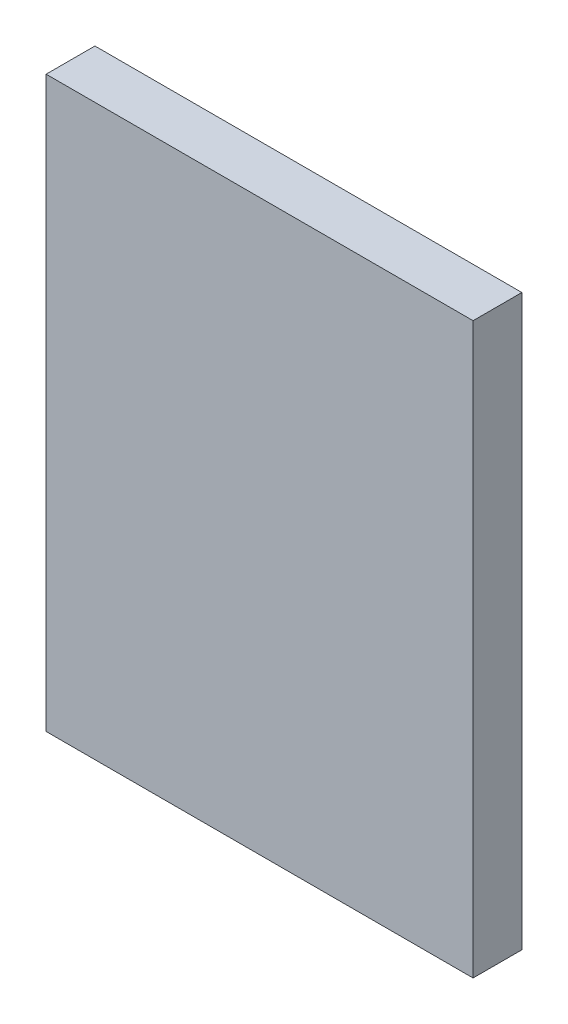
ISO-10303-21;
HEADER;
FILE_DESCRIPTION(('STEP AP214'),'2;1');
FILE_NAME('part.step','',(''),(''),'','','');
FILE_SCHEMA(('AUTOMOTIVE_DESIGN { 1 0 10303 214 1 1 1 1 }'));
ENDSEC;
DATA;
#1=APPLICATION_CONTEXT('core data for automotive mechanical design processes');
#2=APPLICATION_PROTOCOL_DEFINITION('international standard','automotive_design',2000,#1);
#3=PRODUCT_CONTEXT('',#1,'mechanical');
#4=PRODUCT('Part','Part','',(#3));
#5=PRODUCT_RELATED_PRODUCT_CATEGORY('part','',(#4));
#6=PRODUCT_DEFINITION_FORMATION('','',#4);
#7=PRODUCT_DEFINITION_CONTEXT('part definition',#1,'design');
#8=PRODUCT_DEFINITION('design','',#6,#7);
#9=PRODUCT_DEFINITION_SHAPE('','',#8);
#10=(LENGTH_UNIT() NAMED_UNIT(*) SI_UNIT(.MILLI.,.METRE.));
#11=(NAMED_UNIT(*) PLANE_ANGLE_UNIT() SI_UNIT($,.RADIAN.));
#12=(NAMED_UNIT(*) SI_UNIT($,.STERADIAN.) SOLID_ANGLE_UNIT());
#13=UNCERTAINTY_MEASURE_WITH_UNIT(LENGTH_MEASURE(1.E-05),#10,'distance_accuracy_value','');
#14=(GEOMETRIC_REPRESENTATION_CONTEXT(3) GLOBAL_UNCERTAINTY_ASSIGNED_CONTEXT((#13)) GLOBAL_UNIT_ASSIGNED_CONTEXT((#10,
#11,#12)) REPRESENTATION_CONTEXT('',''));
#15=CARTESIAN_POINT('',(0.,0.,0.));
#16=DIRECTION('',(0.,0.,1.));
#17=DIRECTION('',(1.,0.,0.));
#18=AXIS2_PLACEMENT_3D('',#15,#16,#17);
#19=CARTESIAN_POINT('',(7.6283,2.2606,0.76487));
#20=DIRECTION('',(0.,0.,-1.));
#21=DIRECTION('',(-1.,0.,0.));
#22=AXIS2_PLACEMENT_3D('',#19,#20,#21);
#23=PLANE('',#22);
#24=DIRECTION('',(1.,0.,0.));
#25=VECTOR('',#24,1.);
#26=CARTESIAN_POINT('',(7.4783,2.4606,0.76487));
#27=LINE('',#26,#25);
#28=CARTESIAN_POINT('',(7.4783,2.4606,0.76487));
#29=VERTEX_POINT('',#28);
#30=CARTESIAN_POINT('',(7.7783,2.4606,0.76487));
#31=VERTEX_POINT('',#30);
#32=EDGE_CURVE('E55',#29,#31,#27,.T.);
#33=ORIENTED_EDGE('',*,*,#32,.T.);
#34=DIRECTION('',(0.,1.,0.));
#35=VECTOR('',#34,1.);
#36=CARTESIAN_POINT('',(7.7783,2.4606,0.76487));
#37=LINE('',#36,#35);
#38=CARTESIAN_POINT('',(7.7783,2.0606,0.76487));
#39=VERTEX_POINT('',#38);
#40=EDGE_CURVE('E57',#31,#39,#37,.F.);
#41=ORIENTED_EDGE('',*,*,#40,.T.);
#42=DIRECTION('',(1.,0.,0.));
#43=VECTOR('',#42,1.);
#44=CARTESIAN_POINT('',(7.7783,2.0606,0.76487));
#45=LINE('',#44,#43);
#46=CARTESIAN_POINT('',(7.4783,2.0606,0.76487));
#47=VERTEX_POINT('',#46);
#48=EDGE_CURVE('E20',#39,#47,#45,.F.);
#49=ORIENTED_EDGE('',*,*,#48,.T.);
#50=DIRECTION('',(0.,1.,0.));
#51=VECTOR('',#50,1.);
#52=CARTESIAN_POINT('',(7.4783,2.0606,0.76487));
#53=LINE('',#52,#51);
#54=EDGE_CURVE('E80',#47,#29,#53,.T.);
#55=ORIENTED_EDGE('',*,*,#54,.T.);
#56=EDGE_LOOP('',(#33,#41,#49,#55));
#57=FACE_BOUND('',#56,.T.);
#58=ADVANCED_FACE('F17',(#57),#23,.T.);
#59=CARTESIAN_POINT('',(7.7783,2.0606,0.76487));
#60=DIRECTION('',(0.,1.,0.));
#61=DIRECTION('',(0.,0.,1.));
#62=AXIS2_PLACEMENT_3D('',#59,#60,#61);
#63=PLANE('',#62);
#64=DIRECTION('',(0.,0.,1.));
#65=VECTOR('',#64,1.);
#66=CARTESIAN_POINT('',(7.4783,2.0606,0.76487));
#67=LINE('',#66,#65);
#68=CARTESIAN_POINT('',(7.4783,2.0606,0.79916));
#69=VERTEX_POINT('',#68);
#70=EDGE_CURVE('E68',#69,#47,#67,.F.);
#71=ORIENTED_EDGE('',*,*,#70,.T.);
#72=ORIENTED_EDGE('',*,*,#48,.F.);
#73=DIRECTION('',(0.,0.,1.));
#74=VECTOR('',#73,1.);
#75=CARTESIAN_POINT('',(7.7783,2.0606,0.76487));
#76=LINE('',#75,#74);
#77=CARTESIAN_POINT('',(7.7783,2.0606,0.79916));
#78=VERTEX_POINT('',#77);
#79=EDGE_CURVE('E63',#39,#78,#76,.T.);
#80=ORIENTED_EDGE('',*,*,#79,.T.);
#81=DIRECTION('',(1.,0.,0.));
#82=VECTOR('',#81,1.);
#83=CARTESIAN_POINT('',(7.6283,2.0606,0.79916));
#84=LINE('',#83,#82);
#85=EDGE_CURVE('E83',#69,#78,#84,.T.);
#86=ORIENTED_EDGE('',*,*,#85,.F.);
#87=EDGE_LOOP('',(#71,#72,#80,#86));
#88=FACE_BOUND('',#87,.T.);
#89=ADVANCED_FACE('F65',(#88),#63,.F.);
#90=CARTESIAN_POINT('',(7.7783,2.4606,0.76487));
#91=DIRECTION('',(-1.,0.,0.));
#92=DIRECTION('',(0.,0.,1.));
#93=AXIS2_PLACEMENT_3D('',#90,#91,#92);
#94=PLANE('',#93);
#95=ORIENTED_EDGE('',*,*,#79,.F.);
#96=ORIENTED_EDGE('',*,*,#40,.F.);
#97=DIRECTION('',(0.,0.,-1.));
#98=VECTOR('',#97,1.);
#99=CARTESIAN_POINT('',(7.7783,2.4606,0.76487));
#100=LINE('',#99,#98);
#101=CARTESIAN_POINT('',(7.7783,2.4606,0.79916));
#102=VERTEX_POINT('',#101);
#103=EDGE_CURVE('E75',#31,#102,#100,.F.);
#104=ORIENTED_EDGE('',*,*,#103,.T.);
#105=DIRECTION('',(0.,-1.,0.));
#106=VECTOR('',#105,1.);
#107=CARTESIAN_POINT('',(7.7783,2.2606,0.79916));
#108=LINE('',#107,#106);
#109=EDGE_CURVE('E72',#78,#102,#108,.F.);
#110=ORIENTED_EDGE('',*,*,#109,.F.);
#111=EDGE_LOOP('',(#95,#96,#104,#110));
#112=FACE_BOUND('',#111,.T.);
#113=ADVANCED_FACE('F70',(#112),#94,.F.);
#114=CARTESIAN_POINT('',(7.4783,2.4606,0.76487));
#115=DIRECTION('',(0.,-1.,0.));
#116=DIRECTION('',(0.,0.,-1.));
#117=AXIS2_PLACEMENT_3D('',#114,#115,#116);
#118=PLANE('',#117);
#119=ORIENTED_EDGE('',*,*,#103,.F.);
#120=ORIENTED_EDGE('',*,*,#32,.F.);
#121=DIRECTION('',(0.,0.,1.));
#122=VECTOR('',#121,1.);
#123=CARTESIAN_POINT('',(7.4783,2.4606,0.76487));
#124=LINE('',#123,#122);
#125=CARTESIAN_POINT('',(7.4783,2.4606,0.79916));
#126=VERTEX_POINT('',#125);
#127=EDGE_CURVE('E35',#29,#126,#124,.T.);
#128=ORIENTED_EDGE('',*,*,#127,.T.);
#129=DIRECTION('',(1.,0.,0.));
#130=VECTOR('',#129,1.);
#131=CARTESIAN_POINT('',(7.6283,2.4606,0.79916));
#132=LINE('',#131,#130);
#133=EDGE_CURVE('E26',#102,#126,#132,.F.);
#134=ORIENTED_EDGE('',*,*,#133,.F.);
#135=EDGE_LOOP('',(#119,#120,#128,#134));
#136=FACE_BOUND('',#135,.T.);
#137=ADVANCED_FACE('F89',(#136),#118,.F.);
#138=CARTESIAN_POINT('',(7.4783,2.0606,0.76487));
#139=DIRECTION('',(1.,0.,0.));
#140=DIRECTION('',(0.,1.,0.));
#141=AXIS2_PLACEMENT_3D('',#138,#139,#140);
#142=PLANE('',#141);
#143=ORIENTED_EDGE('',*,*,#127,.F.);
#144=ORIENTED_EDGE('',*,*,#54,.F.);
#145=ORIENTED_EDGE('',*,*,#70,.F.);
#146=DIRECTION('',(0.,-1.,0.));
#147=VECTOR('',#146,1.);
#148=CARTESIAN_POINT('',(7.4783,2.2606,0.79916));
#149=LINE('',#148,#147);
#150=EDGE_CURVE('E11',#126,#69,#149,.T.);
#151=ORIENTED_EDGE('',*,*,#150,.F.);
#152=EDGE_LOOP('',(#143,#144,#145,#151));
#153=FACE_BOUND('',#152,.T.);
#154=ADVANCED_FACE('F91',(#153),#142,.F.);
#155=CARTESIAN_POINT('',(7.6283,2.2606,0.79916));
#156=DIRECTION('',(0.,0.,1.));
#157=DIRECTION('',(0.,-1.,0.));
#158=AXIS2_PLACEMENT_3D('',#155,#156,#157);
#159=PLANE('',#158);
#160=ORIENTED_EDGE('',*,*,#133,.T.);
#161=ORIENTED_EDGE('',*,*,#150,.T.);
#162=ORIENTED_EDGE('',*,*,#85,.T.);
#163=ORIENTED_EDGE('',*,*,#109,.T.);
#164=EDGE_LOOP('',(#160,#161,#162,#163));
#165=FACE_BOUND('',#164,.T.);
#166=ADVANCED_FACE('F88',(#165),#159,.T.);
#167=CLOSED_SHELL('',(#58,#89,#113,#137,#154,#166));
#168=MANIFOLD_SOLID_BREP('B1',#167);
#169=ADVANCED_BREP_SHAPE_REPRESENTATION('',(#18,#168),#14);
#170=SHAPE_DEFINITION_REPRESENTATION(#9,#169);
ENDSEC;
END-ISO-10303-21;
